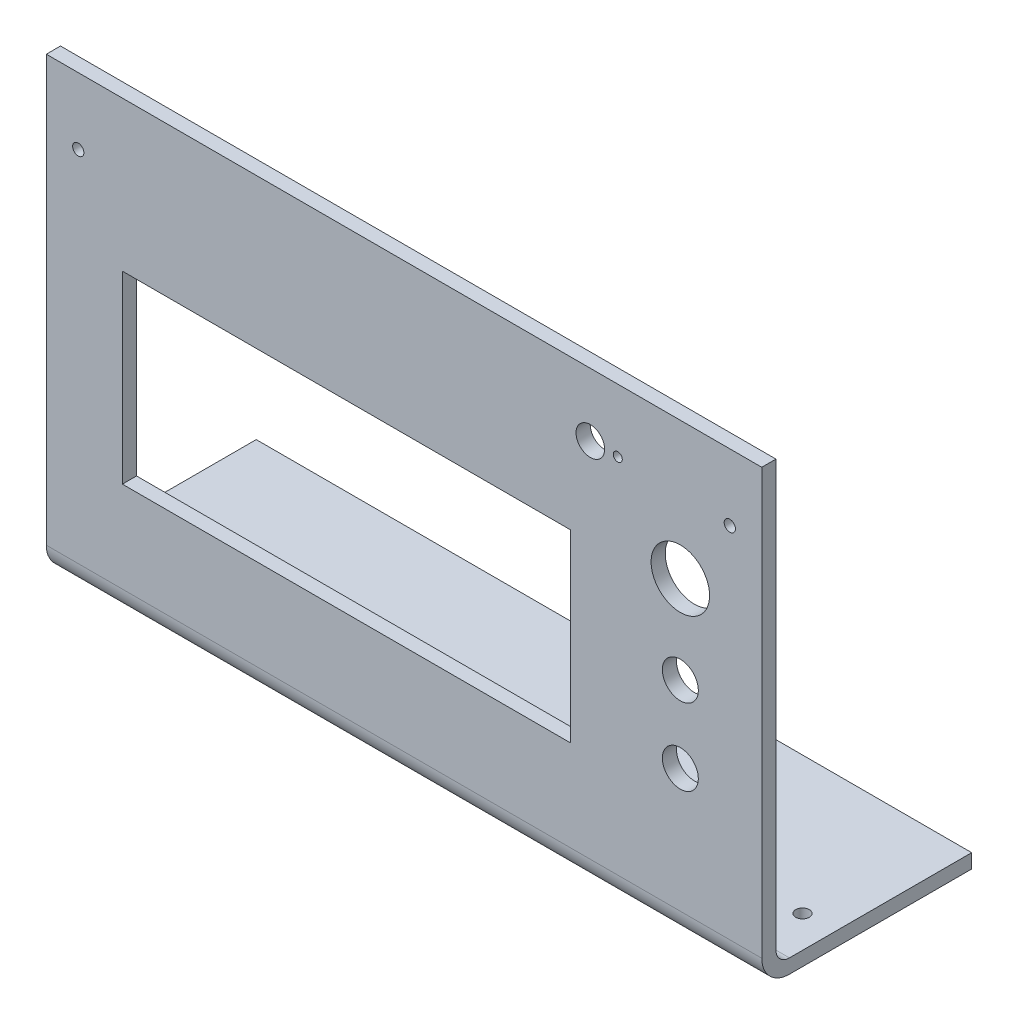
ISO-10303-21;
HEADER;
FILE_DESCRIPTION(('STEP AP214'),'2;1');
FILE_NAME('part.step','',(''),(''),'','','');
FILE_SCHEMA(('AUTOMOTIVE_DESIGN { 1 0 10303 214 1 1 1 1 }'));
ENDSEC;
DATA;
#1=APPLICATION_CONTEXT('core data for automotive mechanical design processes');
#2=APPLICATION_PROTOCOL_DEFINITION('international standard','automotive_design',2000,#1);
#3=PRODUCT_CONTEXT('',#1,'mechanical');
#4=PRODUCT('Part','Part','',(#3));
#5=PRODUCT_RELATED_PRODUCT_CATEGORY('part','',(#4));
#6=PRODUCT_DEFINITION_FORMATION('','',#4);
#7=PRODUCT_DEFINITION_CONTEXT('part definition',#1,'design');
#8=PRODUCT_DEFINITION('design','',#6,#7);
#9=PRODUCT_DEFINITION_SHAPE('','',#8);
#10=(LENGTH_UNIT() NAMED_UNIT(*) SI_UNIT(.MILLI.,.METRE.));
#11=(NAMED_UNIT(*) PLANE_ANGLE_UNIT() SI_UNIT($,.RADIAN.));
#12=(NAMED_UNIT(*) SI_UNIT($,.STERADIAN.) SOLID_ANGLE_UNIT());
#13=UNCERTAINTY_MEASURE_WITH_UNIT(LENGTH_MEASURE(1.E-05),#10,'distance_accuracy_value','');
#14=(GEOMETRIC_REPRESENTATION_CONTEXT(3) GLOBAL_UNCERTAINTY_ASSIGNED_CONTEXT((#13)) GLOBAL_UNIT_ASSIGNED_CONTEXT((#10,
#11,#12)) REPRESENTATION_CONTEXT('',''));
#15=CARTESIAN_POINT('',(0.,0.,0.));
#16=DIRECTION('',(0.,0.,1.));
#17=DIRECTION('',(1.,0.,0.));
#18=AXIS2_PLACEMENT_3D('',#15,#16,#17);
#19=CARTESIAN_POINT('',(0.,0.,3.15));
#20=DIRECTION('',(0.,0.,1.));
#21=DIRECTION('',(1.,0.,0.));
#22=AXIS2_PLACEMENT_3D('',#19,#20,#21);
#23=PLANE('',#22);
#24=CARTESIAN_POINT('',(-13.9,16.5,3.15));
#25=DIRECTION('',(0.,0.,1.));
#26=DIRECTION('',(1.,0.,0.));
#27=AXIS2_PLACEMENT_3D('',#24,#25,#26);
#28=CIRCLE('',#27,1.);
#29=CARTESIAN_POINT('',(-12.9,16.5,3.15));
#30=VERTEX_POINT('',#29);
#31=EDGE_CURVE('E337',#30,#30,#28,.T.);
#32=ORIENTED_EDGE('',*,*,#31,.F.);
#33=EDGE_LOOP('',(#32));
#34=FACE_BOUND('',#33,.T.);
#35=CARTESIAN_POINT('',(-20.,16.5,3.15));
#36=DIRECTION('',(0.,0.,1.));
#37=DIRECTION('',(1.,0.,0.));
#38=AXIS2_PLACEMENT_3D('',#35,#36,#37);
#39=CIRCLE('',#38,3.175);
#40=CARTESIAN_POINT('',(-16.825,16.5,3.15));
#41=VERTEX_POINT('',#40);
#42=EDGE_CURVE('E323',#41,#41,#39,.T.);
#43=ORIENTED_EDGE('',*,*,#42,.F.);
#44=EDGE_LOOP('',(#43));
#45=FACE_BOUND('',#44,.T.);
#46=CARTESIAN_POINT('',(11.,15.7,3.15));
#47=DIRECTION('',(0.,0.,1.));
#48=DIRECTION('',(-1.,0.,0.));
#49=AXIS2_PLACEMENT_3D('',#46,#47,#48);
#50=CIRCLE('',#49,1.25000000000001);
#51=CARTESIAN_POINT('',(9.75,15.7,3.15));
#52=VERTEX_POINT('',#51);
#53=EDGE_CURVE('E310',#52,#52,#50,.T.);
#54=ORIENTED_EDGE('',*,*,#53,.F.);
#55=EDGE_LOOP('',(#54));
#56=FACE_BOUND('',#55,.T.);
#57=CARTESIAN_POINT('',(-133.8,15.7,3.15));
#58=DIRECTION('',(0.,0.,1.));
#59=DIRECTION('',(1.,0.,0.));
#60=AXIS2_PLACEMENT_3D('',#57,#58,#59);
#61=CIRCLE('',#60,1.25000000000001);
#62=CARTESIAN_POINT('',(-132.55,15.7,3.15));
#63=VERTEX_POINT('',#62);
#64=EDGE_CURVE('E197',#63,#63,#61,.T.);
#65=ORIENTED_EDGE('',*,*,#64,.F.);
#66=EDGE_LOOP('',(#65));
#67=FACE_BOUND('',#66,.T.);
#68=CARTESIAN_POINT('',(0.,-36.5,3.15));
#69=DIRECTION('',(0.,0.,1.));
#70=DIRECTION('',(1.,0.,0.));
#71=AXIS2_PLACEMENT_3D('',#68,#69,#70);
#72=CIRCLE('',#71,3.99999999999999);
#73=CARTESIAN_POINT('',(3.99999999999999,-36.5,3.15));
#74=VERTEX_POINT('',#73);
#75=EDGE_CURVE('E240',#74,#74,#72,.T.);
#76=ORIENTED_EDGE('',*,*,#75,.F.);
#77=EDGE_LOOP('',(#76));
#78=FACE_BOUND('',#77,.T.);
#79=DIRECTION('',(-1.,0.,0.));
#80=VECTOR('',#79,1.);
#81=CARTESIAN_POINT('',(-124.,-2.8,3.15));
#82=LINE('',#81,#80);
#83=CARTESIAN_POINT('',(-24.4,-2.8,3.15));
#84=VERTEX_POINT('',#83);
#85=CARTESIAN_POINT('',(-124.,-2.8,3.15));
#86=VERTEX_POINT('',#85);
#87=EDGE_CURVE('E257',#84,#86,#82,.T.);
#88=ORIENTED_EDGE('',*,*,#87,.F.);
#89=DIRECTION('',(0.,1.,0.));
#90=VECTOR('',#89,1.);
#91=CARTESIAN_POINT('',(-24.4,-2.8,3.15));
#92=LINE('',#91,#90);
#93=CARTESIAN_POINT('',(-24.4,-43.8,3.15));
#94=VERTEX_POINT('',#93);
#95=EDGE_CURVE('E254',#94,#84,#92,.T.);
#96=ORIENTED_EDGE('',*,*,#95,.F.);
#97=DIRECTION('',(1.,0.,0.));
#98=VECTOR('',#97,1.);
#99=CARTESIAN_POINT('',(-124.,-43.8,3.15));
#100=LINE('',#99,#98);
#101=CARTESIAN_POINT('',(-124.,-43.8,3.15));
#102=VERTEX_POINT('',#101);
#103=EDGE_CURVE('E264',#102,#94,#100,.T.);
#104=ORIENTED_EDGE('',*,*,#103,.F.);
#105=DIRECTION('',(0.,-1.,0.));
#106=VECTOR('',#105,1.);
#107=CARTESIAN_POINT('',(-124.,-2.8,3.15));
#108=LINE('',#107,#106);
#109=EDGE_CURVE('E261',#86,#102,#108,.T.);
#110=ORIENTED_EDGE('',*,*,#109,.F.);
#111=EDGE_LOOP('',(#88,#96,#104,#110));
#112=FACE_BOUND('',#111,.T.);
#113=DIRECTION('',(0.,1.,0.));
#114=VECTOR('',#113,1.);
#115=CARTESIAN_POINT('',(18.1,30.5,3.15));
#116=LINE('',#115,#114);
#117=CARTESIAN_POINT('',(18.1,-63.9999999999999,3.15000000000011));
#118=VERTEX_POINT('',#117);
#119=CARTESIAN_POINT('',(18.1,30.5,3.15));
#120=VERTEX_POINT('',#119);
#121=EDGE_CURVE('E167',#118,#120,#116,.T.);
#122=ORIENTED_EDGE('',*,*,#121,.T.);
#123=DIRECTION('',(-1.,0.,0.));
#124=VECTOR('',#123,1.);
#125=CARTESIAN_POINT('',(-140.9,30.5,3.15));
#126=LINE('',#125,#124);
#127=CARTESIAN_POINT('',(-140.9,30.5,3.15));
#128=VERTEX_POINT('',#127);
#129=EDGE_CURVE('E294',#120,#128,#126,.T.);
#130=ORIENTED_EDGE('',*,*,#129,.T.);
#131=DIRECTION('',(0.,-1.,0.));
#132=VECTOR('',#131,1.);
#133=CARTESIAN_POINT('',(-140.9,30.5,3.15));
#134=LINE('',#133,#132);
#135=CARTESIAN_POINT('',(-140.9,-63.9999999999999,3.15));
#136=VERTEX_POINT('',#135);
#137=EDGE_CURVE('E297',#128,#136,#134,.T.);
#138=ORIENTED_EDGE('',*,*,#137,.T.);
#139=DIRECTION('',(-1.,0.,0.));
#140=VECTOR('',#139,1.);
#141=CARTESIAN_POINT('',(65.9502351091404,-63.9999999999999,3.15));
#142=LINE('',#141,#140);
#143=EDGE_CURVE('E212',#118,#136,#142,.T.);
#144=ORIENTED_EDGE('',*,*,#143,.F.);
#145=EDGE_LOOP('',(#122,#130,#138,#144));
#146=FACE_BOUND('',#145,.T.);
#147=CARTESIAN_POINT('',(0.,-19.5,3.15));
#148=DIRECTION('',(0.,0.,1.));
#149=DIRECTION('',(1.,0.,0.));
#150=AXIS2_PLACEMENT_3D('',#147,#148,#149);
#151=CIRCLE('',#150,4.00000000000002);
#152=CARTESIAN_POINT('',(4.00000000000002,-19.5,3.15));
#153=VERTEX_POINT('',#152);
#154=EDGE_CURVE('E248',#153,#153,#151,.T.);
#155=ORIENTED_EDGE('',*,*,#154,.F.);
#156=EDGE_LOOP('',(#155));
#157=FACE_BOUND('',#156,.T.);
#158=CARTESIAN_POINT('',(0.,0.,3.15));
#159=DIRECTION('',(0.,0.,1.));
#160=DIRECTION('',(1.,0.,0.));
#161=AXIS2_PLACEMENT_3D('',#158,#159,#160);
#162=CIRCLE('',#161,6.50000000000002);
#163=CARTESIAN_POINT('',(6.50000000000002,0.,3.15));
#164=VERTEX_POINT('',#163);
#165=EDGE_CURVE('E232',#164,#164,#162,.T.);
#166=ORIENTED_EDGE('',*,*,#165,.F.);
#167=EDGE_LOOP('',(#166));
#168=FACE_BOUND('',#167,.T.);
#169=ADVANCED_FACE('F38',(#34,#45,#56,#67,#78,#112,#146,#157,#168),#23,.T.);
#170=CARTESIAN_POINT('',(0.,0.,0.));
#171=DIRECTION('',(0.,0.,1.));
#172=DIRECTION('',(1.,0.,0.));
#173=AXIS2_PLACEMENT_3D('',#170,#171,#172);
#174=PLANE('',#173);
#175=CARTESIAN_POINT('',(-13.9,16.5,0.));
#176=DIRECTION('',(0.,0.,1.));
#177=DIRECTION('',(1.,0.,0.));
#178=AXIS2_PLACEMENT_3D('',#175,#176,#177);
#179=CIRCLE('',#178,1.);
#180=CARTESIAN_POINT('',(-12.9,16.5,0.));
#181=VERTEX_POINT('',#180);
#182=EDGE_CURVE('E42',#181,#181,#179,.T.);
#183=ORIENTED_EDGE('',*,*,#182,.T.);
#184=EDGE_LOOP('',(#183));
#185=FACE_BOUND('',#184,.T.);
#186=CARTESIAN_POINT('',(-20.,16.5,0.));
#187=DIRECTION('',(0.,0.,1.));
#188=DIRECTION('',(1.,0.,0.));
#189=AXIS2_PLACEMENT_3D('',#186,#187,#188);
#190=CIRCLE('',#189,3.175);
#191=CARTESIAN_POINT('',(-16.825,16.5,0.));
#192=VERTEX_POINT('',#191);
#193=EDGE_CURVE('E320',#192,#192,#190,.T.);
#194=ORIENTED_EDGE('',*,*,#193,.T.);
#195=EDGE_LOOP('',(#194));
#196=FACE_BOUND('',#195,.T.);
#197=CARTESIAN_POINT('',(11.,15.7,0.));
#198=DIRECTION('',(0.,0.,1.));
#199=DIRECTION('',(1.,0.,0.));
#200=AXIS2_PLACEMENT_3D('',#197,#198,#199);
#201=CIRCLE('',#200,1.25000000000001);
#202=CARTESIAN_POINT('',(12.25,15.7,0.));
#203=VERTEX_POINT('',#202);
#204=EDGE_CURVE('E306',#203,#203,#201,.T.);
#205=ORIENTED_EDGE('',*,*,#204,.T.);
#206=EDGE_LOOP('',(#205));
#207=FACE_BOUND('',#206,.T.);
#208=CARTESIAN_POINT('',(-133.8,15.7,0.));
#209=DIRECTION('',(0.,0.,1.));
#210=DIRECTION('',(1.,0.,0.));
#211=AXIS2_PLACEMENT_3D('',#208,#209,#210);
#212=CIRCLE('',#211,1.25000000000001);
#213=CARTESIAN_POINT('',(-132.55,15.7,0.));
#214=VERTEX_POINT('',#213);
#215=EDGE_CURVE('E188',#214,#214,#212,.T.);
#216=ORIENTED_EDGE('',*,*,#215,.T.);
#217=EDGE_LOOP('',(#216));
#218=FACE_BOUND('',#217,.T.);
#219=CARTESIAN_POINT('',(0.,-36.5,0.));
#220=DIRECTION('',(0.,0.,1.));
#221=DIRECTION('',(1.,0.,0.));
#222=AXIS2_PLACEMENT_3D('',#219,#220,#221);
#223=CIRCLE('',#222,3.99999999999999);
#224=CARTESIAN_POINT('',(3.99999999999999,-36.5,0.));
#225=VERTEX_POINT('',#224);
#226=EDGE_CURVE('E236',#225,#225,#223,.T.);
#227=ORIENTED_EDGE('',*,*,#226,.T.);
#228=EDGE_LOOP('',(#227));
#229=FACE_BOUND('',#228,.T.);
#230=DIRECTION('',(0.,1.,0.));
#231=VECTOR('',#230,1.);
#232=CARTESIAN_POINT('',(-24.4,-2.8,0.));
#233=LINE('',#232,#231);
#234=CARTESIAN_POINT('',(-24.4,-43.8,0.));
#235=VERTEX_POINT('',#234);
#236=CARTESIAN_POINT('',(-24.4,-2.8,0.));
#237=VERTEX_POINT('',#236);
#238=EDGE_CURVE('E70',#235,#237,#233,.T.);
#239=ORIENTED_EDGE('',*,*,#238,.T.);
#240=DIRECTION('',(-1.,0.,0.));
#241=VECTOR('',#240,1.);
#242=CARTESIAN_POINT('',(-124.,-2.8,0.));
#243=LINE('',#242,#241);
#244=CARTESIAN_POINT('',(-124.,-2.8,0.));
#245=VERTEX_POINT('',#244);
#246=EDGE_CURVE('E270',#237,#245,#243,.T.);
#247=ORIENTED_EDGE('',*,*,#246,.T.);
#248=DIRECTION('',(0.,-1.,0.));
#249=VECTOR('',#248,1.);
#250=CARTESIAN_POINT('',(-124.,-2.8,0.));
#251=LINE('',#250,#249);
#252=CARTESIAN_POINT('',(-124.,-43.8,0.));
#253=VERTEX_POINT('',#252);
#254=EDGE_CURVE('E274',#245,#253,#251,.T.);
#255=ORIENTED_EDGE('',*,*,#254,.T.);
#256=DIRECTION('',(1.,0.,0.));
#257=VECTOR('',#256,1.);
#258=CARTESIAN_POINT('',(-124.,-43.8,0.));
#259=LINE('',#258,#257);
#260=EDGE_CURVE('E258',#253,#235,#259,.T.);
#261=ORIENTED_EDGE('',*,*,#260,.T.);
#262=EDGE_LOOP('',(#239,#247,#255,#261));
#263=FACE_BOUND('',#262,.T.);
#264=DIRECTION('',(0.,1.,0.));
#265=VECTOR('',#264,1.);
#266=CARTESIAN_POINT('',(18.1,30.5,0.));
#267=LINE('',#266,#265);
#268=CARTESIAN_POINT('',(18.1,-64.,0.));
#269=VERTEX_POINT('',#268);
#270=CARTESIAN_POINT('',(18.1,30.5,0.));
#271=VERTEX_POINT('',#270);
#272=EDGE_CURVE('E175',#269,#271,#267,.T.);
#273=ORIENTED_EDGE('',*,*,#272,.F.);
#274=DIRECTION('',(-1.,0.,0.));
#275=VECTOR('',#274,1.);
#276=CARTESIAN_POINT('',(65.9502351091404,-64.,0.));
#277=LINE('',#276,#275);
#278=CARTESIAN_POINT('',(-140.9,-64.,0.));
#279=VERTEX_POINT('',#278);
#280=EDGE_CURVE('E171',#269,#279,#277,.T.);
#281=ORIENTED_EDGE('',*,*,#280,.T.);
#282=DIRECTION('',(0.,-1.,0.));
#283=VECTOR('',#282,1.);
#284=CARTESIAN_POINT('',(-140.9,30.5,0.));
#285=LINE('',#284,#283);
#286=CARTESIAN_POINT('',(-140.9,30.5,0.));
#287=VERTEX_POINT('',#286);
#288=EDGE_CURVE('E157',#287,#279,#285,.T.);
#289=ORIENTED_EDGE('',*,*,#288,.F.);
#290=DIRECTION('',(-1.,0.,0.));
#291=VECTOR('',#290,1.);
#292=CARTESIAN_POINT('',(-140.9,30.5,0.));
#293=LINE('',#292,#291);
#294=EDGE_CURVE('E168',#271,#287,#293,.T.);
#295=ORIENTED_EDGE('',*,*,#294,.F.);
#296=EDGE_LOOP('',(#273,#281,#289,#295));
#297=FACE_BOUND('',#296,.T.);
#298=CARTESIAN_POINT('',(0.,-19.5,0.));
#299=DIRECTION('',(0.,0.,1.));
#300=DIRECTION('',(1.,0.,0.));
#301=AXIS2_PLACEMENT_3D('',#298,#299,#300);
#302=CIRCLE('',#301,4.00000000000002);
#303=CARTESIAN_POINT('',(4.00000000000002,-19.5,0.));
#304=VERTEX_POINT('',#303);
#305=EDGE_CURVE('E244',#304,#304,#302,.T.);
#306=ORIENTED_EDGE('',*,*,#305,.T.);
#307=EDGE_LOOP('',(#306));
#308=FACE_BOUND('',#307,.T.);
#309=CARTESIAN_POINT('',(0.,0.,0.));
#310=DIRECTION('',(0.,0.,1.));
#311=DIRECTION('',(1.,0.,0.));
#312=AXIS2_PLACEMENT_3D('',#309,#310,#311);
#313=CIRCLE('',#312,6.50000000000002);
#314=CARTESIAN_POINT('',(6.50000000000002,0.,0.));
#315=VERTEX_POINT('',#314);
#316=EDGE_CURVE('E231',#315,#315,#313,.T.);
#317=ORIENTED_EDGE('',*,*,#316,.T.);
#318=EDGE_LOOP('',(#317));
#319=FACE_BOUND('',#318,.T.);
#320=ADVANCED_FACE('F172',(#185,#196,#207,#218,#229,#263,#297,#308,#319),#174,.F.);
#321=CARTESIAN_POINT('',(18.1,30.5,3.15));
#322=DIRECTION('',(-1.,0.,0.));
#323=DIRECTION('',(0.,-1.,0.));
#324=AXIS2_PLACEMENT_3D('',#321,#322,#323);
#325=PLANE('',#324);
#326=ORIENTED_EDGE('',*,*,#272,.T.);
#327=DIRECTION('',(0.,0.,-1.));
#328=VECTOR('',#327,1.);
#329=CARTESIAN_POINT('',(18.1,30.5,3.15));
#330=LINE('',#329,#328);
#331=EDGE_CURVE('E11',#120,#271,#330,.T.);
#332=ORIENTED_EDGE('',*,*,#331,.F.);
#333=ORIENTED_EDGE('',*,*,#121,.F.);
#334=CARTESIAN_POINT('',(18.1,-63.9999999999999,-2.99999999999985));
#335=DIRECTION('',(-1.,0.,0.));
#336=DIRECTION('',(0.,-1.,0.));
#337=AXIS2_PLACEMENT_3D('',#334,#335,#336);
#338=CIRCLE('',#337,6.14999999999996);
#339=CARTESIAN_POINT('',(18.1,-70.15,-2.99999999999997));
#340=VERTEX_POINT('',#339);
#341=EDGE_CURVE('E200',#118,#340,#338,.F.);
#342=ORIENTED_EDGE('',*,*,#341,.T.);
#343=DIRECTION('',(0.,0.,-1.));
#344=VECTOR('',#343,1.);
#345=CARTESIAN_POINT('',(18.1,-70.15,-2.99999999999997));
#346=LINE('',#345,#344);
#347=CARTESIAN_POINT('',(18.1,-70.1500000000001,-43.5));
#348=VERTEX_POINT('',#347);
#349=EDGE_CURVE('E353',#340,#348,#346,.T.);
#350=ORIENTED_EDGE('',*,*,#349,.T.);
#351=DIRECTION('',(0.,1.,0.));
#352=VECTOR('',#351,1.);
#353=CARTESIAN_POINT('',(18.1,-70.1500000000001,-43.5));
#354=LINE('',#353,#352);
#355=CARTESIAN_POINT('',(18.1,-67.0000000000001,-43.5));
#356=VERTEX_POINT('',#355);
#357=EDGE_CURVE('E351',#348,#356,#354,.T.);
#358=ORIENTED_EDGE('',*,*,#357,.T.);
#359=DIRECTION('',(0.,0.,1.));
#360=VECTOR('',#359,1.);
#361=CARTESIAN_POINT('',(18.1,-67.0000000000001,-43.5));
#362=LINE('',#361,#360);
#363=CARTESIAN_POINT('',(18.1,-66.9999999999999,-3.00000000000014));
#364=VERTEX_POINT('',#363);
#365=EDGE_CURVE('E216',#356,#364,#362,.T.);
#366=ORIENTED_EDGE('',*,*,#365,.T.);
#367=CARTESIAN_POINT('',(18.1,-63.9999999999999,-3.00000000000015));
#368=DIRECTION('',(-1.,0.,0.));
#369=DIRECTION('',(0.,-1.,0.));
#370=AXIS2_PLACEMENT_3D('',#367,#368,#369);
#371=CIRCLE('',#370,3.00000000000007);
#372=EDGE_CURVE('E228',#364,#269,#371,.T.);
#373=ORIENTED_EDGE('',*,*,#372,.T.);
#374=EDGE_LOOP('',(#326,#332,#333,#342,#350,#358,#366,#373));
#375=FACE_BOUND('',#374,.T.);
#376=ADVANCED_FACE('F40',(#375),#325,.F.);
#377=CARTESIAN_POINT('',(-140.9,30.5,3.15));
#378=DIRECTION('',(0.,-1.,0.));
#379=DIRECTION('',(1.,0.,0.));
#380=AXIS2_PLACEMENT_3D('',#377,#378,#379);
#381=PLANE('',#380);
#382=ORIENTED_EDGE('',*,*,#294,.T.);
#383=DIRECTION('',(0.,0.,-1.));
#384=VECTOR('',#383,1.);
#385=CARTESIAN_POINT('',(-140.9,30.5,3.15));
#386=LINE('',#385,#384);
#387=EDGE_CURVE('E48',#128,#287,#386,.T.);
#388=ORIENTED_EDGE('',*,*,#387,.F.);
#389=ORIENTED_EDGE('',*,*,#129,.F.);
#390=ORIENTED_EDGE('',*,*,#331,.T.);
#391=EDGE_LOOP('',(#382,#388,#389,#390));
#392=FACE_BOUND('',#391,.T.);
#393=ADVANCED_FACE('F378',(#392),#381,.F.);
#394=CARTESIAN_POINT('',(-140.9,30.5,3.15));
#395=DIRECTION('',(1.,0.,0.));
#396=DIRECTION('',(0.,0.,-1.));
#397=AXIS2_PLACEMENT_3D('',#394,#395,#396);
#398=PLANE('',#397);
#399=ORIENTED_EDGE('',*,*,#288,.T.);
#400=CARTESIAN_POINT('',(-140.9,-63.9999999999999,-3.00000000000015));
#401=DIRECTION('',(1.,0.,0.));
#402=DIRECTION('',(0.,0.,1.));
#403=AXIS2_PLACEMENT_3D('',#400,#401,#402);
#404=CIRCLE('',#403,3.00000000000007);
#405=CARTESIAN_POINT('',(-140.9,-66.9999999999999,-3.00000000000014));
#406=VERTEX_POINT('',#405);
#407=EDGE_CURVE('E162',#279,#406,#404,.T.);
#408=ORIENTED_EDGE('',*,*,#407,.T.);
#409=DIRECTION('',(0.,0.,-1.));
#410=VECTOR('',#409,1.);
#411=CARTESIAN_POINT('',(-140.9,-67.0000000000001,-43.5));
#412=LINE('',#411,#410);
#413=CARTESIAN_POINT('',(-140.9,-67.0000000000001,-43.5));
#414=VERTEX_POINT('',#413);
#415=EDGE_CURVE('E187',#406,#414,#412,.T.);
#416=ORIENTED_EDGE('',*,*,#415,.T.);
#417=DIRECTION('',(0.,-1.,0.));
#418=VECTOR('',#417,1.);
#419=CARTESIAN_POINT('',(-140.9,-70.1500000000001,-43.5));
#420=LINE('',#419,#418);
#421=CARTESIAN_POINT('',(-140.9,-70.1500000000001,-43.5));
#422=VERTEX_POINT('',#421);
#423=EDGE_CURVE('E193',#414,#422,#420,.T.);
#424=ORIENTED_EDGE('',*,*,#423,.T.);
#425=DIRECTION('',(0.,0.,1.));
#426=VECTOR('',#425,1.);
#427=CARTESIAN_POINT('',(-140.9,-70.15,-2.99999999999997));
#428=LINE('',#427,#426);
#429=CARTESIAN_POINT('',(-140.9,-70.1499999999998,-2.99999999999997));
#430=VERTEX_POINT('',#429);
#431=EDGE_CURVE('E206',#422,#430,#428,.T.);
#432=ORIENTED_EDGE('',*,*,#431,.T.);
#433=CARTESIAN_POINT('',(-140.9,-63.9999999999999,-2.99999999999985));
#434=DIRECTION('',(-1.,0.,0.));
#435=DIRECTION('',(0.,0.,-1.));
#436=AXIS2_PLACEMENT_3D('',#433,#434,#435);
#437=CIRCLE('',#436,6.14999999999996);
#438=EDGE_CURVE('E181',#430,#136,#437,.T.);
#439=ORIENTED_EDGE('',*,*,#438,.T.);
#440=ORIENTED_EDGE('',*,*,#137,.F.);
#441=ORIENTED_EDGE('',*,*,#387,.T.);
#442=EDGE_LOOP('',(#399,#408,#416,#424,#432,#439,#440,#441));
#443=FACE_BOUND('',#442,.T.);
#444=ADVANCED_FACE('F159',(#443),#398,.F.);
#445=CARTESIAN_POINT('',(-24.4,-2.8,3.15));
#446=DIRECTION('',(-1.,0.,0.));
#447=DIRECTION('',(0.,0.,1.));
#448=AXIS2_PLACEMENT_3D('',#445,#446,#447);
#449=PLANE('',#448);
#450=ORIENTED_EDGE('',*,*,#238,.F.);
#451=DIRECTION('',(0.,0.,-1.));
#452=VECTOR('',#451,1.);
#453=CARTESIAN_POINT('',(-24.4,-43.8,3.15));
#454=LINE('',#453,#452);
#455=EDGE_CURVE('E267',#94,#235,#454,.T.);
#456=ORIENTED_EDGE('',*,*,#455,.F.);
#457=ORIENTED_EDGE('',*,*,#95,.T.);
#458=DIRECTION('',(0.,0.,-1.));
#459=VECTOR('',#458,1.);
#460=CARTESIAN_POINT('',(-24.4,-2.8,3.15));
#461=LINE('',#460,#459);
#462=EDGE_CURVE('E288',#84,#237,#461,.T.);
#463=ORIENTED_EDGE('',*,*,#462,.T.);
#464=EDGE_LOOP('',(#450,#456,#457,#463));
#465=FACE_BOUND('',#464,.T.);
#466=ADVANCED_FACE('F404',(#465),#449,.T.);
#467=CARTESIAN_POINT('',(-124.,-2.8,3.15));
#468=DIRECTION('',(0.,-1.,0.));
#469=DIRECTION('',(0.,0.,-1.));
#470=AXIS2_PLACEMENT_3D('',#467,#468,#469);
#471=PLANE('',#470);
#472=ORIENTED_EDGE('',*,*,#246,.F.);
#473=ORIENTED_EDGE('',*,*,#462,.F.);
#474=ORIENTED_EDGE('',*,*,#87,.T.);
#475=DIRECTION('',(0.,0.,-1.));
#476=VECTOR('',#475,1.);
#477=CARTESIAN_POINT('',(-124.,-2.8,3.15));
#478=LINE('',#477,#476);
#479=EDGE_CURVE('E285',#86,#245,#478,.T.);
#480=ORIENTED_EDGE('',*,*,#479,.T.);
#481=EDGE_LOOP('',(#472,#473,#474,#480));
#482=FACE_BOUND('',#481,.T.);
#483=ADVANCED_FACE('F422',(#482),#471,.T.);
#484=CARTESIAN_POINT('',(-124.,-2.8,3.15));
#485=DIRECTION('',(1.,0.,0.));
#486=DIRECTION('',(0.,1.,0.));
#487=AXIS2_PLACEMENT_3D('',#484,#485,#486);
#488=PLANE('',#487);
#489=ORIENTED_EDGE('',*,*,#254,.F.);
#490=ORIENTED_EDGE('',*,*,#479,.F.);
#491=ORIENTED_EDGE('',*,*,#109,.T.);
#492=DIRECTION('',(0.,0.,-1.));
#493=VECTOR('',#492,1.);
#494=CARTESIAN_POINT('',(-124.,-43.8,3.15));
#495=LINE('',#494,#493);
#496=EDGE_CURVE('E59',#102,#253,#495,.T.);
#497=ORIENTED_EDGE('',*,*,#496,.T.);
#498=EDGE_LOOP('',(#489,#490,#491,#497));
#499=FACE_BOUND('',#498,.T.);
#500=ADVANCED_FACE('F427',(#499),#488,.T.);
#501=CARTESIAN_POINT('',(-124.,-43.8,3.15));
#502=DIRECTION('',(0.,1.,0.));
#503=DIRECTION('',(0.,0.,1.));
#504=AXIS2_PLACEMENT_3D('',#501,#502,#503);
#505=PLANE('',#504);
#506=ORIENTED_EDGE('',*,*,#260,.F.);
#507=ORIENTED_EDGE('',*,*,#496,.F.);
#508=ORIENTED_EDGE('',*,*,#103,.T.);
#509=ORIENTED_EDGE('',*,*,#455,.T.);
#510=EDGE_LOOP('',(#506,#507,#508,#509));
#511=FACE_BOUND('',#510,.T.);
#512=ADVANCED_FACE('F435',(#511),#505,.T.);
#513=CARTESIAN_POINT('',(0.,-19.5,3.15));
#514=DIRECTION('',(0.,0.,-1.));
#515=DIRECTION('',(-1.,0.,0.));
#516=AXIS2_PLACEMENT_3D('',#513,#514,#515);
#517=CYLINDRICAL_SURFACE('',#516,4.00000000000002);
#518=ORIENTED_EDGE('',*,*,#154,.T.);
#519=EDGE_LOOP('',(#518));
#520=FACE_BOUND('',#519,.T.);
#521=ORIENTED_EDGE('',*,*,#305,.F.);
#522=EDGE_LOOP('',(#521));
#523=FACE_BOUND('',#522,.T.);
#524=ADVANCED_FACE('F443',(#520,#523),#517,.F.);
#525=CARTESIAN_POINT('',(0.,-36.5,3.15));
#526=DIRECTION('',(0.,0.,-1.));
#527=DIRECTION('',(-1.,0.,0.));
#528=AXIS2_PLACEMENT_3D('',#525,#526,#527);
#529=CYLINDRICAL_SURFACE('',#528,3.99999999999999);
#530=ORIENTED_EDGE('',*,*,#75,.T.);
#531=EDGE_LOOP('',(#530));
#532=FACE_BOUND('',#531,.T.);
#533=ORIENTED_EDGE('',*,*,#226,.F.);
#534=EDGE_LOOP('',(#533));
#535=FACE_BOUND('',#534,.T.);
#536=ADVANCED_FACE('F391',(#532,#535),#529,.F.);
#537=CARTESIAN_POINT('',(0.,0.,3.15));
#538=DIRECTION('',(0.,0.,-1.));
#539=DIRECTION('',(-1.,0.,0.));
#540=AXIS2_PLACEMENT_3D('',#537,#538,#539);
#541=CYLINDRICAL_SURFACE('',#540,6.50000000000002);
#542=ORIENTED_EDGE('',*,*,#165,.T.);
#543=EDGE_LOOP('',(#542));
#544=FACE_BOUND('',#543,.T.);
#545=ORIENTED_EDGE('',*,*,#316,.F.);
#546=EDGE_LOOP('',(#545));
#547=FACE_BOUND('',#546,.T.);
#548=ADVANCED_FACE('F388',(#544,#547),#541,.F.);
#549=CARTESIAN_POINT('',(65.9502351091404,-63.9999999999999,-2.99999999999985));
#550=DIRECTION('',(-1.,0.,0.));
#551=DIRECTION('',(0.,0.,1.));
#552=AXIS2_PLACEMENT_3D('',#549,#550,#551);
#553=CYLINDRICAL_SURFACE('',#552,6.14999999999996);
#554=ORIENTED_EDGE('',*,*,#341,.F.);
#555=ORIENTED_EDGE('',*,*,#143,.T.);
#556=ORIENTED_EDGE('',*,*,#438,.F.);
#557=DIRECTION('',(-1.,0.,0.));
#558=VECTOR('',#557,1.);
#559=CARTESIAN_POINT('',(65.9502351091404,-70.1499999999998,-2.99999999999997));
#560=LINE('',#559,#558);
#561=EDGE_CURVE('E217',#340,#430,#560,.T.);
#562=ORIENTED_EDGE('',*,*,#561,.F.);
#563=EDGE_LOOP('',(#554,#555,#556,#562));
#564=FACE_BOUND('',#563,.T.);
#565=ADVANCED_FACE('F369',(#564),#553,.T.);
#566=CARTESIAN_POINT('',(65.9502351091404,-70.15,-2.99999999999997));
#567=DIRECTION('',(0.,-1.,0.));
#568=DIRECTION('',(0.,0.,-1.));
#569=AXIS2_PLACEMENT_3D('',#566,#567,#568);
#570=PLANE('',#569);
#571=CARTESIAN_POINT('',(11.,-70.15,-13.));
#572=DIRECTION('',(0.,-1.,0.));
#573=DIRECTION('',(0.,0.,1.));
#574=AXIS2_PLACEMENT_3D('',#571,#572,#573);
#575=CIRCLE('',#574,1.5);
#576=CARTESIAN_POINT('',(11.,-70.15,-11.5));
#577=VERTEX_POINT('',#576);
#578=EDGE_CURVE('E319',#577,#577,#575,.T.);
#579=ORIENTED_EDGE('',*,*,#578,.F.);
#580=EDGE_LOOP('',(#579));
#581=FACE_BOUND('',#580,.T.);
#582=CARTESIAN_POINT('',(-133.8,-70.15,-13.));
#583=DIRECTION('',(0.,-1.,0.));
#584=DIRECTION('',(0.,0.,-1.));
#585=AXIS2_PLACEMENT_3D('',#582,#583,#584);
#586=CIRCLE('',#585,1.5);
#587=CARTESIAN_POINT('',(-133.8,-70.15,-14.5));
#588=VERTEX_POINT('',#587);
#589=EDGE_CURVE('E315',#588,#588,#586,.T.);
#590=ORIENTED_EDGE('',*,*,#589,.F.);
#591=EDGE_LOOP('',(#590));
#592=FACE_BOUND('',#591,.T.);
#593=ORIENTED_EDGE('',*,*,#349,.F.);
#594=ORIENTED_EDGE('',*,*,#561,.T.);
#595=ORIENTED_EDGE('',*,*,#431,.F.);
#596=DIRECTION('',(-1.,0.,0.));
#597=VECTOR('',#596,1.);
#598=CARTESIAN_POINT('',(65.9502351091404,-70.1500000000001,-43.5));
#599=LINE('',#598,#597);
#600=EDGE_CURVE('E220',#348,#422,#599,.T.);
#601=ORIENTED_EDGE('',*,*,#600,.F.);
#602=EDGE_LOOP('',(#593,#594,#595,#601));
#603=FACE_BOUND('',#602,.T.);
#604=ADVANCED_FACE('F366',(#581,#592,#603),#570,.T.);
#605=CARTESIAN_POINT('',(65.9502351091404,-70.1500000000001,-43.5));
#606=DIRECTION('',(0.,0.,-1.));
#607=DIRECTION('',(-1.,0.,0.));
#608=AXIS2_PLACEMENT_3D('',#605,#606,#607);
#609=PLANE('',#608);
#610=ORIENTED_EDGE('',*,*,#357,.F.);
#611=ORIENTED_EDGE('',*,*,#600,.T.);
#612=ORIENTED_EDGE('',*,*,#423,.F.);
#613=DIRECTION('',(-1.,0.,0.));
#614=VECTOR('',#613,1.);
#615=CARTESIAN_POINT('',(65.9502351091404,-67.0000000000001,-43.5));
#616=LINE('',#615,#614);
#617=EDGE_CURVE('E223',#356,#414,#616,.T.);
#618=ORIENTED_EDGE('',*,*,#617,.F.);
#619=EDGE_LOOP('',(#610,#611,#612,#618));
#620=FACE_BOUND('',#619,.T.);
#621=ADVANCED_FACE('F373',(#620),#609,.T.);
#622=CARTESIAN_POINT('',(65.9502351091404,-67.0000000000001,-43.5));
#623=DIRECTION('',(0.,1.,0.));
#624=DIRECTION('',(0.,0.,1.));
#625=AXIS2_PLACEMENT_3D('',#622,#623,#624);
#626=PLANE('',#625);
#627=CARTESIAN_POINT('',(11.,-66.9999999999999,-13.));
#628=DIRECTION('',(0.,1.,0.));
#629=DIRECTION('',(0.,0.,1.));
#630=AXIS2_PLACEMENT_3D('',#627,#628,#629);
#631=CIRCLE('',#630,1.5);
#632=CARTESIAN_POINT('',(11.,-66.9999999999999,-11.5));
#633=VERTEX_POINT('',#632);
#634=EDGE_CURVE('E316',#633,#633,#631,.T.);
#635=ORIENTED_EDGE('',*,*,#634,.F.);
#636=EDGE_LOOP('',(#635));
#637=FACE_BOUND('',#636,.T.);
#638=CARTESIAN_POINT('',(-133.8,-66.9999999999999,-13.));
#639=DIRECTION('',(0.,1.,0.));
#640=DIRECTION('',(0.,0.,1.));
#641=AXIS2_PLACEMENT_3D('',#638,#639,#640);
#642=CIRCLE('',#641,1.5);
#643=CARTESIAN_POINT('',(-133.8,-66.9999999999999,-11.5));
#644=VERTEX_POINT('',#643);
#645=EDGE_CURVE('E311',#644,#644,#642,.T.);
#646=ORIENTED_EDGE('',*,*,#645,.F.);
#647=EDGE_LOOP('',(#646));
#648=FACE_BOUND('',#647,.T.);
#649=ORIENTED_EDGE('',*,*,#365,.F.);
#650=ORIENTED_EDGE('',*,*,#617,.T.);
#651=ORIENTED_EDGE('',*,*,#415,.F.);
#652=DIRECTION('',(-1.,0.,0.));
#653=VECTOR('',#652,1.);
#654=CARTESIAN_POINT('',(65.9502351091404,-66.9999999999999,-3.00000000000014));
#655=LINE('',#654,#653);
#656=EDGE_CURVE('E180',#364,#406,#655,.T.);
#657=ORIENTED_EDGE('',*,*,#656,.F.);
#658=EDGE_LOOP('',(#649,#650,#651,#657));
#659=FACE_BOUND('',#658,.T.);
#660=ADVANCED_FACE('F376',(#637,#648,#659),#626,.T.);
#661=CARTESIAN_POINT('',(65.9502351091404,-63.9999999999999,-3.00000000000015));
#662=DIRECTION('',(-1.,0.,0.));
#663=DIRECTION('',(0.,0.,1.));
#664=AXIS2_PLACEMENT_3D('',#661,#662,#663);
#665=CYLINDRICAL_SURFACE('',#664,3.00000000000007);
#666=ORIENTED_EDGE('',*,*,#372,.F.);
#667=ORIENTED_EDGE('',*,*,#656,.T.);
#668=ORIENTED_EDGE('',*,*,#407,.F.);
#669=ORIENTED_EDGE('',*,*,#280,.F.);
#670=EDGE_LOOP('',(#666,#667,#668,#669));
#671=FACE_BOUND('',#670,.T.);
#672=ADVANCED_FACE('F183',(#671),#665,.F.);
#673=CARTESIAN_POINT('',(-133.8,15.7,-43.5));
#674=DIRECTION('',(0.,0.,1.));
#675=DIRECTION('',(1.,0.,0.));
#676=AXIS2_PLACEMENT_3D('',#673,#674,#675);
#677=CYLINDRICAL_SURFACE('',#676,1.25000000000001);
#678=ORIENTED_EDGE('',*,*,#64,.T.);
#679=EDGE_LOOP('',(#678));
#680=FACE_BOUND('',#679,.T.);
#681=ORIENTED_EDGE('',*,*,#215,.F.);
#682=EDGE_LOOP('',(#681));
#683=FACE_BOUND('',#682,.T.);
#684=ADVANCED_FACE('F488',(#680,#683),#677,.F.);
#685=CARTESIAN_POINT('',(11.,15.7,-43.5));
#686=DIRECTION('',(0.,0.,1.));
#687=DIRECTION('',(1.,0.,0.));
#688=AXIS2_PLACEMENT_3D('',#685,#686,#687);
#689=CYLINDRICAL_SURFACE('',#688,1.25000000000001);
#690=ORIENTED_EDGE('',*,*,#53,.T.);
#691=EDGE_LOOP('',(#690));
#692=FACE_BOUND('',#691,.T.);
#693=ORIENTED_EDGE('',*,*,#204,.F.);
#694=EDGE_LOOP('',(#693));
#695=FACE_BOUND('',#694,.T.);
#696=ADVANCED_FACE('F493',(#692,#695),#689,.F.);
#697=CARTESIAN_POINT('',(-133.8,30.5000000000001,-13.0000000000003));
#698=DIRECTION('',(0.,-1.,0.));
#699=DIRECTION('',(0.,0.,-1.));
#700=AXIS2_PLACEMENT_3D('',#697,#698,#699);
#701=CYLINDRICAL_SURFACE('',#700,1.5);
#702=ORIENTED_EDGE('',*,*,#645,.T.);
#703=EDGE_LOOP('',(#702));
#704=FACE_BOUND('',#703,.T.);
#705=ORIENTED_EDGE('',*,*,#589,.T.);
#706=EDGE_LOOP('',(#705));
#707=FACE_BOUND('',#706,.T.);
#708=ADVANCED_FACE('F501',(#704,#707),#701,.F.);
#709=CARTESIAN_POINT('',(11.,30.5000000000001,-13.0000000000003));
#710=DIRECTION('',(0.,-1.,0.));
#711=DIRECTION('',(0.,0.,-1.));
#712=AXIS2_PLACEMENT_3D('',#709,#710,#711);
#713=CYLINDRICAL_SURFACE('',#712,1.5);
#714=ORIENTED_EDGE('',*,*,#634,.T.);
#715=EDGE_LOOP('',(#714));
#716=FACE_BOUND('',#715,.T.);
#717=ORIENTED_EDGE('',*,*,#578,.T.);
#718=EDGE_LOOP('',(#717));
#719=FACE_BOUND('',#718,.T.);
#720=ADVANCED_FACE('F509',(#716,#719),#713,.F.);
#721=CARTESIAN_POINT('',(-20.,16.5,-43.5));
#722=DIRECTION('',(0.,0.,1.));
#723=DIRECTION('',(1.,0.,0.));
#724=AXIS2_PLACEMENT_3D('',#721,#722,#723);
#725=CYLINDRICAL_SURFACE('',#724,3.175);
#726=ORIENTED_EDGE('',*,*,#42,.T.);
#727=EDGE_LOOP('',(#726));
#728=FACE_BOUND('',#727,.T.);
#729=ORIENTED_EDGE('',*,*,#193,.F.);
#730=EDGE_LOOP('',(#729));
#731=FACE_BOUND('',#730,.T.);
#732=ADVANCED_FACE('F517',(#728,#731),#725,.F.);
#733=CARTESIAN_POINT('',(-13.9,16.5,-43.5));
#734=DIRECTION('',(0.,0.,1.));
#735=DIRECTION('',(1.,0.,0.));
#736=AXIS2_PLACEMENT_3D('',#733,#734,#735);
#737=CYLINDRICAL_SURFACE('',#736,1.);
#738=ORIENTED_EDGE('',*,*,#31,.T.);
#739=EDGE_LOOP('',(#738));
#740=FACE_BOUND('',#739,.T.);
#741=ORIENTED_EDGE('',*,*,#182,.F.);
#742=EDGE_LOOP('',(#741));
#743=FACE_BOUND('',#742,.T.);
#744=ADVANCED_FACE('F526',(#740,#743),#737,.F.);
#745=CLOSED_SHELL('',(#169,#320,#376,#393,#444,#466,#483,#500,#512,#524,#536,#548,#565,#604,
#621,#660,#672,#684,#696,#708,#720,#732,#744));
#746=MANIFOLD_SOLID_BREP('B2',#745);
#747=ADVANCED_BREP_SHAPE_REPRESENTATION('',(#18,#746),#14);
#748=SHAPE_DEFINITION_REPRESENTATION(#9,#747);
ENDSEC;
END-ISO-10303-21;
